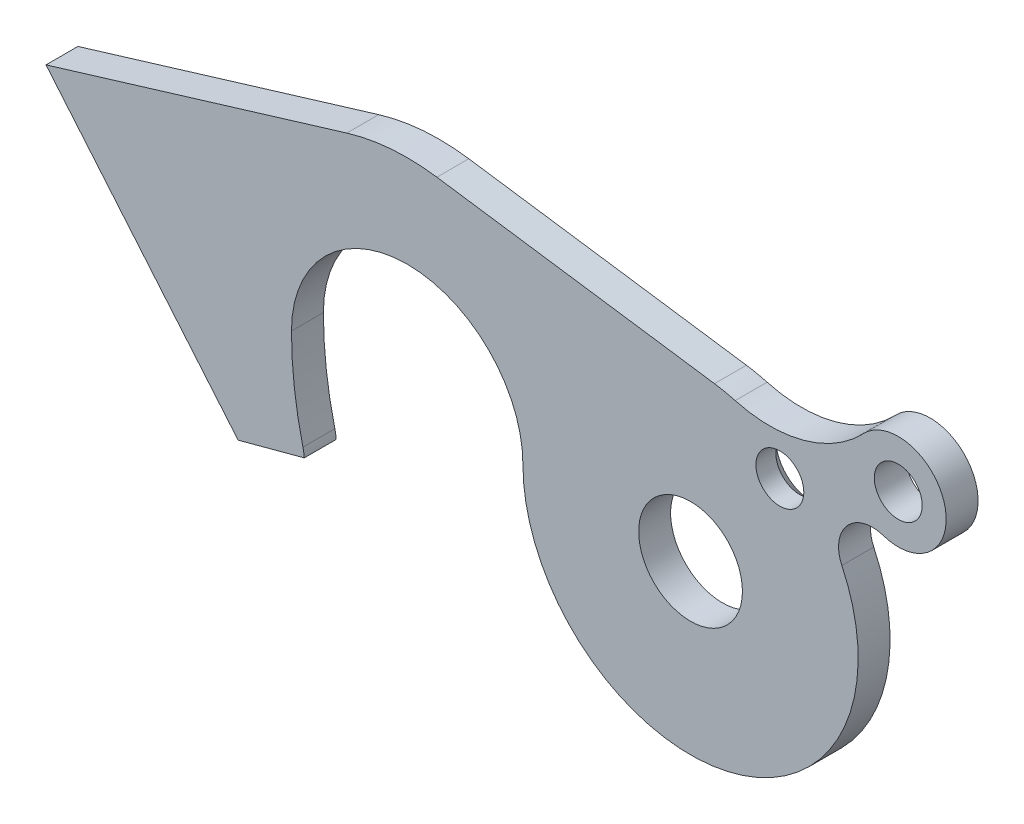
ISO-10303-21;
HEADER;
FILE_DESCRIPTION(('STEP AP214'),'2;1');
FILE_NAME('part.step','',(''),(''),'','','');
FILE_SCHEMA(('AUTOMOTIVE_DESIGN { 1 0 10303 214 1 1 1 1 }'));
ENDSEC;
DATA;
#1=APPLICATION_CONTEXT('core data for automotive mechanical design processes');
#2=APPLICATION_PROTOCOL_DEFINITION('international standard','automotive_design',2000,#1);
#3=PRODUCT_CONTEXT('',#1,'mechanical');
#4=PRODUCT('Part','Part','',(#3));
#5=PRODUCT_RELATED_PRODUCT_CATEGORY('part','',(#4));
#6=PRODUCT_DEFINITION_FORMATION('','',#4);
#7=PRODUCT_DEFINITION_CONTEXT('part definition',#1,'design');
#8=PRODUCT_DEFINITION('design','',#6,#7);
#9=PRODUCT_DEFINITION_SHAPE('','',#8);
#10=(LENGTH_UNIT() NAMED_UNIT(*) SI_UNIT(.MILLI.,.METRE.));
#11=(NAMED_UNIT(*) PLANE_ANGLE_UNIT() SI_UNIT($,.RADIAN.));
#12=(NAMED_UNIT(*) SI_UNIT($,.STERADIAN.) SOLID_ANGLE_UNIT());
#13=UNCERTAINTY_MEASURE_WITH_UNIT(LENGTH_MEASURE(1.E-05),#10,'distance_accuracy_value','');
#14=(GEOMETRIC_REPRESENTATION_CONTEXT(3) GLOBAL_UNCERTAINTY_ASSIGNED_CONTEXT((#13)) GLOBAL_UNIT_ASSIGNED_CONTEXT((#10,
#11,#12)) REPRESENTATION_CONTEXT('',''));
#15=CARTESIAN_POINT('',(0.,0.,0.));
#16=DIRECTION('',(0.,0.,1.));
#17=DIRECTION('',(1.,0.,0.));
#18=AXIS2_PLACEMENT_3D('',#15,#16,#17);
#19=CARTESIAN_POINT('',(-35.5,0.,4.));
#20=DIRECTION('',(0.,0.,1.));
#21=DIRECTION('',(1.,0.,0.));
#22=AXIS2_PLACEMENT_3D('',#19,#20,#21);
#23=PLANE('',#22);
#24=CARTESIAN_POINT('',(0.,0.,4.));
#25=DIRECTION('',(0.,0.,1.));
#26=DIRECTION('',(1.,0.,0.));
#27=AXIS2_PLACEMENT_3D('',#24,#25,#26);
#28=CIRCLE('',#27,6.50000000000001);
#29=CARTESIAN_POINT('',(6.50000000000001,0.,4.));
#30=VERTEX_POINT('',#29);
#31=EDGE_CURVE('E340',#30,#30,#28,.T.);
#32=ORIENTED_EDGE('',*,*,#31,.F.);
#33=EDGE_LOOP('',(#32));
#34=FACE_BOUND('',#33,.T.);
#35=CARTESIAN_POINT('',(-35.5,0.,4.));
#36=DIRECTION('',(0.,0.,1.));
#37=DIRECTION('',(1.,0.,0.));
#38=AXIS2_PLACEMENT_3D('',#35,#36,#37);
#39=CIRCLE('',#38,26.0647693737917);
#40=CARTESIAN_POINT('',(-31.781350826498,25.7981365767639,4.));
#41=VERTEX_POINT('',#40);
#42=CARTESIAN_POINT('',(-43.0721371201122,24.9406283389807,4.));
#43=VERTEX_POINT('',#42);
#44=EDGE_CURVE('E191',#41,#43,#39,.T.);
#45=ORIENTED_EDGE('',*,*,#44,.T.);
#46=DIRECTION('',(-0.956871245676883,-0.290512339147186,0.));
#47=VECTOR('',#46,1.);
#48=CARTESIAN_POINT('',(-43.0721371201122,24.9406283389807,4.));
#49=LINE('',#48,#47);
#50=CARTESIAN_POINT('',(-80.7545581910476,13.5000000000001,4.));
#51=VERTEX_POINT('',#50);
#52=EDGE_CURVE('E114',#43,#51,#49,.T.);
#53=ORIENTED_EDGE('',*,*,#52,.T.);
#54=DIRECTION('',(0.642787609686544,-0.766044443118975,0.));
#55=VECTOR('',#54,1.);
#56=CARTESIAN_POINT('',(-56.6824532304385,-15.1880175681104,4.));
#57=LINE('',#56,#55);
#58=CARTESIAN_POINT('',(-56.6824532304385,-15.1880175681104,4.));
#59=VERTEX_POINT('',#58);
#60=EDGE_CURVE('E303',#51,#59,#57,.T.);
#61=ORIENTED_EDGE('',*,*,#60,.T.);
#62=DIRECTION('',(0.96592582628907,0.258819045102516,0.));
#63=VECTOR('',#62,1.);
#64=CARTESIAN_POINT('',(-56.6824532304385,-15.1880175681104,4.));
#65=LINE('',#64,#63);
#66=CARTESIAN_POINT('',(-48.3929453203943,-12.9668506179627,4.));
#67=VERTEX_POINT('',#66);
#68=EDGE_CURVE('E305',#59,#67,#65,.T.);
#69=ORIENTED_EDGE('',*,*,#68,.T.);
#70=CARTESIAN_POINT('',(-55.1585775575961,-13.5,4.));
#71=DIRECTION('',(0.,0.,1.));
#72=DIRECTION('',(1.,0.,0.));
#73=AXIS2_PLACEMENT_3D('',#70,#71,#72);
#74=CIRCLE('',#73,6.78660650344715);
#75=CARTESIAN_POINT('',(-48.5665379161614,-11.8866056903581,4.));
#76=VERTEX_POINT('',#75);
#77=EDGE_CURVE('E307',#67,#76,#74,.T.);
#78=ORIENTED_EDGE('',*,*,#77,.T.);
#79=CARTESIAN_POINT('',(0.,0.,4.));
#80=DIRECTION('',(0.,0.,-1.));
#81=DIRECTION('',(1.,0.,0.));
#82=AXIS2_PLACEMENT_3D('',#79,#80,#81);
#83=CIRCLE('',#82,50.);
#84=CARTESIAN_POINT('',(-50.,0.,4.));
#85=VERTEX_POINT('',#84);
#86=EDGE_CURVE('E313',#76,#85,#83,.T.);
#87=ORIENTED_EDGE('',*,*,#86,.T.);
#88=CARTESIAN_POINT('',(-35.5,0.,4.));
#89=DIRECTION('',(0.,0.,-1.));
#90=DIRECTION('',(1.,0.,0.));
#91=AXIS2_PLACEMENT_3D('',#88,#89,#90);
#92=CIRCLE('',#91,14.5);
#93=CARTESIAN_POINT('',(-21.,0.,4.));
#94=VERTEX_POINT('',#93);
#95=EDGE_CURVE('E315',#85,#94,#92,.T.);
#96=ORIENTED_EDGE('',*,*,#95,.T.);
#97=CARTESIAN_POINT('',(0.,0.,4.));
#98=DIRECTION('',(0.,0.,1.));
#99=DIRECTION('',(1.,0.,0.));
#100=AXIS2_PLACEMENT_3D('',#97,#98,#99);
#101=CIRCLE('',#100,21.);
#102=CARTESIAN_POINT('',(18.9565120963816,9.03607487462012,4.));
#103=VERTEX_POINT('',#102);
#104=EDGE_CURVE('E317',#94,#103,#101,.T.);
#105=ORIENTED_EDGE('',*,*,#104,.T.);
#106=CARTESIAN_POINT('',(22.7846790467629,10.8608622099863,4.));
#107=DIRECTION('',(0.,0.,-1.));
#108=DIRECTION('',(1.,0.,0.));
#109=AXIS2_PLACEMENT_3D('',#106,#107,#108);
#110=CIRCLE('',#109,4.24083848069045);
#111=CARTESIAN_POINT('',(24.127078994475,14.8836315794241,4.));
#112=VERTEX_POINT('',#111);
#113=EDGE_CURVE('E319',#103,#112,#110,.T.);
#114=ORIENTED_EDGE('',*,*,#113,.T.);
#115=CARTESIAN_POINT('',(26.0263259766335,20.5751042272336,4.));
#116=DIRECTION('',(0.,0.,1.));
#117=DIRECTION('',(1.,0.,0.));
#118=AXIS2_PLACEMENT_3D('',#115,#116,#117);
#119=CIRCLE('',#118,6.00000000000009);
#120=CARTESIAN_POINT('',(21.6754577198551,24.7066832730899,4.));
#121=VERTEX_POINT('',#120);
#122=EDGE_CURVE('E148',#112,#121,#119,.T.);
#123=ORIENTED_EDGE('',*,*,#122,.T.);
#124=CARTESIAN_POINT('',(9.91327085181248,35.876041187281,4.));
#125=DIRECTION('',(0.,0.,-1.));
#126=DIRECTION('',(1.,0.,0.));
#127=AXIS2_PLACEMENT_3D('',#124,#125,#126);
#128=CIRCLE('',#127,16.2204684314004);
#129=CARTESIAN_POINT('',(5.59312380153807,20.2414665017303,4.));
#130=VERTEX_POINT('',#129);
#131=EDGE_CURVE('E142',#121,#130,#128,.T.);
#132=ORIENTED_EDGE('',*,*,#131,.T.);
#133=CARTESIAN_POINT('',(0.,0.,4.));
#134=DIRECTION('',(0.,0.,1.));
#135=DIRECTION('',(1.,0.,0.));
#136=AXIS2_PLACEMENT_3D('',#133,#134,#135);
#137=CIRCLE('',#136,21.);
#138=CARTESIAN_POINT('',(2.99606075632744,20.7851778906123,4.));
#139=VERTEX_POINT('',#138);
#140=EDGE_CURVE('E146',#130,#139,#137,.T.);
#141=ORIENTED_EDGE('',*,*,#140,.T.);
#142=DIRECTION('',(-0.989770375743439,0.142669559825116,0.));
#143=VECTOR('',#142,1.);
#144=CARTESIAN_POINT('',(-31.781350826498,25.7981365767639,4.));
#145=LINE('',#144,#143);
#146=EDGE_CURVE('E55',#139,#41,#145,.T.);
#147=ORIENTED_EDGE('',*,*,#146,.T.);
#148=EDGE_LOOP('',(#45,#53,#61,#69,#78,#87,#96,#105,#114,#123,#132,#141,#147));
#149=FACE_BOUND('',#148,.T.);
#150=CARTESIAN_POINT('',(11.1898425511107,14.5852161177453,4.));
#151=DIRECTION('',(0.,0.,1.));
#152=DIRECTION('',(1.,0.,0.));
#153=AXIS2_PLACEMENT_3D('',#150,#151,#152);
#154=CIRCLE('',#153,3.);
#155=CARTESIAN_POINT('',(14.1898425511107,14.5852161177453,4.));
#156=VERTEX_POINT('',#155);
#157=EDGE_CURVE('E170',#156,#156,#154,.T.);
#158=ORIENTED_EDGE('',*,*,#157,.F.);
#159=EDGE_LOOP('',(#158));
#160=FACE_BOUND('',#159,.T.);
#161=CARTESIAN_POINT('',(26.0263259766335,20.5751042272336,4.));
#162=DIRECTION('',(0.,0.,1.));
#163=DIRECTION('',(1.,0.,0.));
#164=AXIS2_PLACEMENT_3D('',#161,#162,#163);
#165=CIRCLE('',#164,3.);
#166=CARTESIAN_POINT('',(29.0263259766335,20.5751042272336,4.));
#167=VERTEX_POINT('',#166);
#168=EDGE_CURVE('E344',#167,#167,#165,.T.);
#169=ORIENTED_EDGE('',*,*,#168,.F.);
#170=EDGE_LOOP('',(#169));
#171=FACE_BOUND('',#170,.T.);
#172=ADVANCED_FACE('F38',(#34,#149,#160,#171),#23,.T.);
#173=CARTESIAN_POINT('',(-35.5,0.,0.));
#174=DIRECTION('',(0.,0.,1.));
#175=DIRECTION('',(1.,0.,0.));
#176=AXIS2_PLACEMENT_3D('',#173,#174,#175);
#177=PLANE('',#176);
#178=CARTESIAN_POINT('',(11.1898425511107,14.5852161177453,0.));
#179=DIRECTION('',(0.,0.,1.));
#180=DIRECTION('',(1.,0.,0.));
#181=AXIS2_PLACEMENT_3D('',#178,#179,#180);
#182=CIRCLE('',#181,4.50000000000002);
#183=CARTESIAN_POINT('',(15.6898425511108,14.5852161177453,0.));
#184=VERTEX_POINT('',#183);
#185=EDGE_CURVE('E47',#184,#184,#182,.T.);
#186=ORIENTED_EDGE('',*,*,#185,.T.);
#187=EDGE_LOOP('',(#186));
#188=FACE_BOUND('',#187,.T.);
#189=CARTESIAN_POINT('',(-35.5,0.,0.));
#190=DIRECTION('',(0.,0.,1.));
#191=DIRECTION('',(1.,0.,0.));
#192=AXIS2_PLACEMENT_3D('',#189,#190,#191);
#193=CIRCLE('',#192,26.0647693737917);
#194=CARTESIAN_POINT('',(-31.781350826498,25.7981365767639,0.));
#195=VERTEX_POINT('',#194);
#196=CARTESIAN_POINT('',(-43.0721371201122,24.9406283389807,0.));
#197=VERTEX_POINT('',#196);
#198=EDGE_CURVE('E166',#195,#197,#193,.T.);
#199=ORIENTED_EDGE('',*,*,#198,.F.);
#200=DIRECTION('',(-0.989770375743439,0.142669559825116,0.));
#201=VECTOR('',#200,1.);
#202=CARTESIAN_POINT('',(-31.781350826498,25.7981365767639,0.));
#203=LINE('',#202,#201);
#204=CARTESIAN_POINT('',(2.99606075632744,20.7851778906123,0.));
#205=VERTEX_POINT('',#204);
#206=EDGE_CURVE('E105',#205,#195,#203,.T.);
#207=ORIENTED_EDGE('',*,*,#206,.F.);
#208=CARTESIAN_POINT('',(0.,0.,0.));
#209=DIRECTION('',(0.,0.,1.));
#210=DIRECTION('',(1.,0.,0.));
#211=AXIS2_PLACEMENT_3D('',#208,#209,#210);
#212=CIRCLE('',#211,21.);
#213=CARTESIAN_POINT('',(5.59312380153807,20.2414665017303,0.));
#214=VERTEX_POINT('',#213);
#215=EDGE_CURVE('E99',#214,#205,#212,.T.);
#216=ORIENTED_EDGE('',*,*,#215,.F.);
#217=CARTESIAN_POINT('',(9.91327085181248,35.876041187281,0.));
#218=DIRECTION('',(0.,0.,-1.));
#219=DIRECTION('',(1.,0.,0.));
#220=AXIS2_PLACEMENT_3D('',#217,#218,#219);
#221=CIRCLE('',#220,16.2204684314004);
#222=CARTESIAN_POINT('',(21.6754577198551,24.7066832730899,0.));
#223=VERTEX_POINT('',#222);
#224=EDGE_CURVE('E156',#223,#214,#221,.T.);
#225=ORIENTED_EDGE('',*,*,#224,.F.);
#226=CARTESIAN_POINT('',(26.0263259766335,20.5751042272336,0.));
#227=DIRECTION('',(0.,0.,1.));
#228=DIRECTION('',(1.,0.,0.));
#229=AXIS2_PLACEMENT_3D('',#226,#227,#228);
#230=CIRCLE('',#229,6.00000000000009);
#231=CARTESIAN_POINT('',(24.127078994475,14.8836315794241,0.));
#232=VERTEX_POINT('',#231);
#233=EDGE_CURVE('E186',#232,#223,#230,.T.);
#234=ORIENTED_EDGE('',*,*,#233,.F.);
#235=CARTESIAN_POINT('',(22.7846790467629,10.8608622099863,0.));
#236=DIRECTION('',(0.,0.,-1.));
#237=DIRECTION('',(1.,0.,0.));
#238=AXIS2_PLACEMENT_3D('',#235,#236,#237);
#239=CIRCLE('',#238,4.24083848069045);
#240=CARTESIAN_POINT('',(18.9565120963816,9.03607487462012,0.));
#241=VERTEX_POINT('',#240);
#242=EDGE_CURVE('E184',#241,#232,#239,.T.);
#243=ORIENTED_EDGE('',*,*,#242,.F.);
#244=CARTESIAN_POINT('',(0.,0.,0.));
#245=DIRECTION('',(0.,0.,1.));
#246=DIRECTION('',(1.,0.,0.));
#247=AXIS2_PLACEMENT_3D('',#244,#245,#246);
#248=CIRCLE('',#247,21.);
#249=CARTESIAN_POINT('',(-21.,0.,0.));
#250=VERTEX_POINT('',#249);
#251=EDGE_CURVE('E182',#250,#241,#248,.T.);
#252=ORIENTED_EDGE('',*,*,#251,.F.);
#253=CARTESIAN_POINT('',(-35.5,0.,0.));
#254=DIRECTION('',(0.,0.,-1.));
#255=DIRECTION('',(1.,0.,0.));
#256=AXIS2_PLACEMENT_3D('',#253,#254,#255);
#257=CIRCLE('',#256,14.5);
#258=CARTESIAN_POINT('',(-50.,0.,0.));
#259=VERTEX_POINT('',#258);
#260=EDGE_CURVE('E180',#259,#250,#257,.T.);
#261=ORIENTED_EDGE('',*,*,#260,.F.);
#262=CARTESIAN_POINT('',(0.,0.,0.));
#263=DIRECTION('',(0.,0.,-1.));
#264=DIRECTION('',(1.,0.,0.));
#265=AXIS2_PLACEMENT_3D('',#262,#263,#264);
#266=CIRCLE('',#265,50.);
#267=CARTESIAN_POINT('',(-48.5665379161614,-11.8866056903581,0.));
#268=VERTEX_POINT('',#267);
#269=EDGE_CURVE('E178',#268,#259,#266,.T.);
#270=ORIENTED_EDGE('',*,*,#269,.F.);
#271=CARTESIAN_POINT('',(-55.1585775575961,-13.5,0.));
#272=DIRECTION('',(0.,0.,1.));
#273=DIRECTION('',(1.,0.,0.));
#274=AXIS2_PLACEMENT_3D('',#271,#272,#273);
#275=CIRCLE('',#274,6.78660650344715);
#276=CARTESIAN_POINT('',(-48.3929453203943,-12.9668506179627,0.));
#277=VERTEX_POINT('',#276);
#278=EDGE_CURVE('E176',#277,#268,#275,.T.);
#279=ORIENTED_EDGE('',*,*,#278,.F.);
#280=DIRECTION('',(0.96592582628907,0.258819045102516,0.));
#281=VECTOR('',#280,1.);
#282=CARTESIAN_POINT('',(-56.6824532304385,-15.1880175681104,0.));
#283=LINE('',#282,#281);
#284=CARTESIAN_POINT('',(-56.6824532304385,-15.1880175681104,0.));
#285=VERTEX_POINT('',#284);
#286=EDGE_CURVE('E174',#285,#277,#283,.T.);
#287=ORIENTED_EDGE('',*,*,#286,.F.);
#288=DIRECTION('',(0.642787609686544,-0.766044443118975,0.));
#289=VECTOR('',#288,1.);
#290=CARTESIAN_POINT('',(-56.6824532304385,-15.1880175681104,0.));
#291=LINE('',#290,#289);
#292=CARTESIAN_POINT('',(-80.7545581910476,13.5000000000001,0.));
#293=VERTEX_POINT('',#292);
#294=EDGE_CURVE('E172',#293,#285,#291,.T.);
#295=ORIENTED_EDGE('',*,*,#294,.F.);
#296=DIRECTION('',(-0.956871245676883,-0.290512339147186,0.));
#297=VECTOR('',#296,1.);
#298=CARTESIAN_POINT('',(-43.0721371201122,24.9406283389807,0.));
#299=LINE('',#298,#297);
#300=EDGE_CURVE('E169',#197,#293,#299,.T.);
#301=ORIENTED_EDGE('',*,*,#300,.F.);
#302=EDGE_LOOP('',(#199,#207,#216,#225,#234,#243,#252,#261,#270,#279,#287,#295,#301));
#303=FACE_BOUND('',#302,.T.);
#304=CARTESIAN_POINT('',(0.,0.,0.));
#305=DIRECTION('',(0.,0.,1.));
#306=DIRECTION('',(1.,0.,0.));
#307=AXIS2_PLACEMENT_3D('',#304,#305,#306);
#308=CIRCLE('',#307,6.50000000000001);
#309=CARTESIAN_POINT('',(6.50000000000001,0.,0.));
#310=VERTEX_POINT('',#309);
#311=EDGE_CURVE('E341',#310,#310,#308,.T.);
#312=ORIENTED_EDGE('',*,*,#311,.T.);
#313=EDGE_LOOP('',(#312));
#314=FACE_BOUND('',#313,.T.);
#315=CARTESIAN_POINT('',(26.0263259766335,20.5751042272336,0.));
#316=DIRECTION('',(0.,0.,1.));
#317=DIRECTION('',(1.,0.,0.));
#318=AXIS2_PLACEMENT_3D('',#315,#316,#317);
#319=CIRCLE('',#318,3.);
#320=CARTESIAN_POINT('',(29.0263259766335,20.5751042272336,0.));
#321=VERTEX_POINT('',#320);
#322=EDGE_CURVE('E347',#321,#321,#319,.T.);
#323=ORIENTED_EDGE('',*,*,#322,.T.);
#324=EDGE_LOOP('',(#323));
#325=FACE_BOUND('',#324,.T.);
#326=ADVANCED_FACE('F223',(#188,#303,#314,#325),#177,.F.);
#327=CARTESIAN_POINT('',(-35.5,0.,4.));
#328=DIRECTION('',(0.,0.,-1.));
#329=DIRECTION('',(-1.,0.,0.));
#330=AXIS2_PLACEMENT_3D('',#327,#328,#329);
#331=CYLINDRICAL_SURFACE('',#330,26.0647693737917);
#332=ORIENTED_EDGE('',*,*,#198,.T.);
#333=DIRECTION('',(0.,0.,-1.));
#334=VECTOR('',#333,1.);
#335=CARTESIAN_POINT('',(-43.0721371201122,24.9406283389807,4.));
#336=LINE('',#335,#334);
#337=EDGE_CURVE('E219',#43,#197,#336,.T.);
#338=ORIENTED_EDGE('',*,*,#337,.F.);
#339=ORIENTED_EDGE('',*,*,#44,.F.);
#340=DIRECTION('',(0.,0.,-1.));
#341=VECTOR('',#340,1.);
#342=CARTESIAN_POINT('',(-31.781350826498,25.7981365767639,4.));
#343=LINE('',#342,#341);
#344=EDGE_CURVE('E162',#41,#195,#343,.T.);
#345=ORIENTED_EDGE('',*,*,#344,.T.);
#346=EDGE_LOOP('',(#332,#338,#339,#345));
#347=FACE_BOUND('',#346,.T.);
#348=ADVANCED_FACE('F243',(#347),#331,.T.);
#349=CARTESIAN_POINT('',(-43.0721371201122,24.9406283389807,4.));
#350=DIRECTION('',(0.290512339147186,-0.956871245676883,0.));
#351=DIRECTION('',(0.956871245676883,0.290512339147186,0.));
#352=AXIS2_PLACEMENT_3D('',#349,#350,#351);
#353=PLANE('',#352);
#354=ORIENTED_EDGE('',*,*,#300,.T.);
#355=DIRECTION('',(0.,0.,-1.));
#356=VECTOR('',#355,1.);
#357=CARTESIAN_POINT('',(-80.7545581910476,13.5000000000001,4.));
#358=LINE('',#357,#356);
#359=EDGE_CURVE('E216',#51,#293,#358,.T.);
#360=ORIENTED_EDGE('',*,*,#359,.F.);
#361=ORIENTED_EDGE('',*,*,#52,.F.);
#362=ORIENTED_EDGE('',*,*,#337,.T.);
#363=EDGE_LOOP('',(#354,#360,#361,#362));
#364=FACE_BOUND('',#363,.T.);
#365=ADVANCED_FACE('F288',(#364),#353,.F.);
#366=CARTESIAN_POINT('',(-56.6824532304385,-15.1880175681104,4.));
#367=DIRECTION('',(0.766044443118975,0.642787609686544,0.));
#368=DIRECTION('',(-0.642787609686544,0.766044443118975,0.));
#369=AXIS2_PLACEMENT_3D('',#366,#367,#368);
#370=PLANE('',#369);
#371=ORIENTED_EDGE('',*,*,#294,.T.);
#372=DIRECTION('',(0.,0.,-1.));
#373=VECTOR('',#372,1.);
#374=CARTESIAN_POINT('',(-56.6824532304385,-15.1880175681104,4.));
#375=LINE('',#374,#373);
#376=EDGE_CURVE('E213',#59,#285,#375,.T.);
#377=ORIENTED_EDGE('',*,*,#376,.F.);
#378=ORIENTED_EDGE('',*,*,#60,.F.);
#379=ORIENTED_EDGE('',*,*,#359,.T.);
#380=EDGE_LOOP('',(#371,#377,#378,#379));
#381=FACE_BOUND('',#380,.T.);
#382=ADVANCED_FACE('F284',(#381),#370,.F.);
#383=CARTESIAN_POINT('',(-56.6824532304385,-15.1880175681104,4.));
#384=DIRECTION('',(-0.258819045102516,0.96592582628907,0.));
#385=DIRECTION('',(-0.96592582628907,-0.258819045102516,0.));
#386=AXIS2_PLACEMENT_3D('',#383,#384,#385);
#387=PLANE('',#386);
#388=ORIENTED_EDGE('',*,*,#286,.T.);
#389=DIRECTION('',(0.,0.,-1.));
#390=VECTOR('',#389,1.);
#391=CARTESIAN_POINT('',(-48.3929453203943,-12.9668506179627,4.));
#392=LINE('',#391,#390);
#393=EDGE_CURVE('E210',#67,#277,#392,.T.);
#394=ORIENTED_EDGE('',*,*,#393,.F.);
#395=ORIENTED_EDGE('',*,*,#68,.F.);
#396=ORIENTED_EDGE('',*,*,#376,.T.);
#397=EDGE_LOOP('',(#388,#394,#395,#396));
#398=FACE_BOUND('',#397,.T.);
#399=ADVANCED_FACE('F280',(#398),#387,.F.);
#400=CARTESIAN_POINT('',(-55.1585775575961,-13.5,4.));
#401=DIRECTION('',(0.,0.,-1.));
#402=DIRECTION('',(-1.,0.,0.));
#403=AXIS2_PLACEMENT_3D('',#400,#401,#402);
#404=CYLINDRICAL_SURFACE('',#403,6.78660650344715);
#405=ORIENTED_EDGE('',*,*,#278,.T.);
#406=DIRECTION('',(0.,0.,-1.));
#407=VECTOR('',#406,1.);
#408=CARTESIAN_POINT('',(-48.5665379161614,-11.8866056903581,4.));
#409=LINE('',#408,#407);
#410=EDGE_CURVE('E207',#76,#268,#409,.T.);
#411=ORIENTED_EDGE('',*,*,#410,.F.);
#412=ORIENTED_EDGE('',*,*,#77,.F.);
#413=ORIENTED_EDGE('',*,*,#393,.T.);
#414=EDGE_LOOP('',(#405,#411,#412,#413));
#415=FACE_BOUND('',#414,.T.);
#416=ADVANCED_FACE('F276',(#415),#404,.T.);
#417=CARTESIAN_POINT('',(0.,0.,4.));
#418=DIRECTION('',(0.,0.,-1.));
#419=DIRECTION('',(-1.,0.,0.));
#420=AXIS2_PLACEMENT_3D('',#417,#418,#419);
#421=CYLINDRICAL_SURFACE('',#420,50.);
#422=ORIENTED_EDGE('',*,*,#269,.T.);
#423=DIRECTION('',(0.,0.,-1.));
#424=VECTOR('',#423,1.);
#425=CARTESIAN_POINT('',(-50.,0.,4.));
#426=LINE('',#425,#424);
#427=EDGE_CURVE('E204',#85,#259,#426,.T.);
#428=ORIENTED_EDGE('',*,*,#427,.F.);
#429=ORIENTED_EDGE('',*,*,#86,.F.);
#430=ORIENTED_EDGE('',*,*,#410,.T.);
#431=EDGE_LOOP('',(#422,#428,#429,#430));
#432=FACE_BOUND('',#431,.T.);
#433=ADVANCED_FACE('F272',(#432),#421,.F.);
#434=CARTESIAN_POINT('',(-35.5,0.,4.));
#435=DIRECTION('',(0.,0.,-1.));
#436=DIRECTION('',(-1.,0.,0.));
#437=AXIS2_PLACEMENT_3D('',#434,#435,#436);
#438=CYLINDRICAL_SURFACE('',#437,14.5);
#439=ORIENTED_EDGE('',*,*,#260,.T.);
#440=DIRECTION('',(0.,0.,-1.));
#441=VECTOR('',#440,1.);
#442=CARTESIAN_POINT('',(-21.,0.,4.));
#443=LINE('',#442,#441);
#444=EDGE_CURVE('E201',#94,#250,#443,.T.);
#445=ORIENTED_EDGE('',*,*,#444,.F.);
#446=ORIENTED_EDGE('',*,*,#95,.F.);
#447=ORIENTED_EDGE('',*,*,#427,.T.);
#448=EDGE_LOOP('',(#439,#445,#446,#447));
#449=FACE_BOUND('',#448,.T.);
#450=ADVANCED_FACE('F268',(#449),#438,.F.);
#451=CARTESIAN_POINT('',(0.,0.,4.));
#452=DIRECTION('',(0.,0.,-1.));
#453=DIRECTION('',(-1.,0.,0.));
#454=AXIS2_PLACEMENT_3D('',#451,#452,#453);
#455=CYLINDRICAL_SURFACE('',#454,21.);
#456=ORIENTED_EDGE('',*,*,#251,.T.);
#457=DIRECTION('',(0.,0.,-1.));
#458=VECTOR('',#457,1.);
#459=CARTESIAN_POINT('',(18.9565120963816,9.03607487462012,4.));
#460=LINE('',#459,#458);
#461=EDGE_CURVE('E198',#103,#241,#460,.T.);
#462=ORIENTED_EDGE('',*,*,#461,.F.);
#463=ORIENTED_EDGE('',*,*,#104,.F.);
#464=ORIENTED_EDGE('',*,*,#444,.T.);
#465=EDGE_LOOP('',(#456,#462,#463,#464));
#466=FACE_BOUND('',#465,.T.);
#467=ADVANCED_FACE('F264',(#466),#455,.T.);
#468=CARTESIAN_POINT('',(22.7846790467629,10.8608622099863,4.));
#469=DIRECTION('',(0.,0.,-1.));
#470=DIRECTION('',(-1.,0.,0.));
#471=AXIS2_PLACEMENT_3D('',#468,#469,#470);
#472=CYLINDRICAL_SURFACE('',#471,4.24083848069045);
#473=ORIENTED_EDGE('',*,*,#242,.T.);
#474=DIRECTION('',(0.,0.,-1.));
#475=VECTOR('',#474,1.);
#476=CARTESIAN_POINT('',(24.127078994475,14.8836315794241,4.));
#477=LINE('',#476,#475);
#478=EDGE_CURVE('E195',#112,#232,#477,.T.);
#479=ORIENTED_EDGE('',*,*,#478,.F.);
#480=ORIENTED_EDGE('',*,*,#113,.F.);
#481=ORIENTED_EDGE('',*,*,#461,.T.);
#482=EDGE_LOOP('',(#473,#479,#480,#481));
#483=FACE_BOUND('',#482,.T.);
#484=ADVANCED_FACE('F260',(#483),#472,.F.);
#485=CARTESIAN_POINT('',(26.0263259766335,20.5751042272336,4.));
#486=DIRECTION('',(0.,0.,-1.));
#487=DIRECTION('',(-1.,0.,0.));
#488=AXIS2_PLACEMENT_3D('',#485,#486,#487);
#489=CYLINDRICAL_SURFACE('',#488,6.00000000000009);
#490=ORIENTED_EDGE('',*,*,#233,.T.);
#491=DIRECTION('',(0.,0.,-1.));
#492=VECTOR('',#491,1.);
#493=CARTESIAN_POINT('',(21.6754577198551,24.7066832730899,4.));
#494=LINE('',#493,#492);
#495=EDGE_CURVE('E157',#121,#223,#494,.T.);
#496=ORIENTED_EDGE('',*,*,#495,.F.);
#497=ORIENTED_EDGE('',*,*,#122,.F.);
#498=ORIENTED_EDGE('',*,*,#478,.T.);
#499=EDGE_LOOP('',(#490,#496,#497,#498));
#500=FACE_BOUND('',#499,.T.);
#501=ADVANCED_FACE('F257',(#500),#489,.T.);
#502=CARTESIAN_POINT('',(9.91327085181248,35.876041187281,4.));
#503=DIRECTION('',(0.,0.,-1.));
#504=DIRECTION('',(-1.,0.,0.));
#505=AXIS2_PLACEMENT_3D('',#502,#503,#504);
#506=CYLINDRICAL_SURFACE('',#505,16.2204684314004);
#507=ORIENTED_EDGE('',*,*,#224,.T.);
#508=DIRECTION('',(0.,0.,-1.));
#509=VECTOR('',#508,1.);
#510=CARTESIAN_POINT('',(5.59312380153807,20.2414665017303,4.));
#511=LINE('',#510,#509);
#512=EDGE_CURVE('E153',#130,#214,#511,.T.);
#513=ORIENTED_EDGE('',*,*,#512,.F.);
#514=ORIENTED_EDGE('',*,*,#131,.F.);
#515=ORIENTED_EDGE('',*,*,#495,.T.);
#516=EDGE_LOOP('',(#507,#513,#514,#515));
#517=FACE_BOUND('',#516,.T.);
#518=ADVANCED_FACE('F154',(#517),#506,.F.);
#519=CARTESIAN_POINT('',(0.,0.,4.));
#520=DIRECTION('',(0.,0.,-1.));
#521=DIRECTION('',(-1.,0.,0.));
#522=AXIS2_PLACEMENT_3D('',#519,#520,#521);
#523=CYLINDRICAL_SURFACE('',#522,21.);
#524=ORIENTED_EDGE('',*,*,#215,.T.);
#525=DIRECTION('',(0.,0.,-1.));
#526=VECTOR('',#525,1.);
#527=CARTESIAN_POINT('',(2.99606075632744,20.7851778906123,4.));
#528=LINE('',#527,#526);
#529=EDGE_CURVE('E158',#139,#205,#528,.T.);
#530=ORIENTED_EDGE('',*,*,#529,.F.);
#531=ORIENTED_EDGE('',*,*,#140,.F.);
#532=ORIENTED_EDGE('',*,*,#512,.T.);
#533=EDGE_LOOP('',(#524,#530,#531,#532));
#534=FACE_BOUND('',#533,.T.);
#535=ADVANCED_FACE('F160',(#534),#523,.T.);
#536=CARTESIAN_POINT('',(-31.781350826498,25.7981365767639,4.));
#537=DIRECTION('',(-0.142669559825116,-0.989770375743439,0.));
#538=DIRECTION('',(0.989770375743439,-0.142669559825116,0.));
#539=AXIS2_PLACEMENT_3D('',#536,#537,#538);
#540=PLANE('',#539);
#541=ORIENTED_EDGE('',*,*,#206,.T.);
#542=ORIENTED_EDGE('',*,*,#344,.F.);
#543=ORIENTED_EDGE('',*,*,#146,.F.);
#544=ORIENTED_EDGE('',*,*,#529,.T.);
#545=EDGE_LOOP('',(#541,#542,#543,#544));
#546=FACE_BOUND('',#545,.T.);
#547=ADVANCED_FACE('F250',(#546),#540,.F.);
#548=CARTESIAN_POINT('',(11.1898425511107,14.5852161177453,4.));
#549=DIRECTION('',(0.,0.,-1.));
#550=DIRECTION('',(-1.,0.,0.));
#551=AXIS2_PLACEMENT_3D('',#548,#549,#550);
#552=CYLINDRICAL_SURFACE('',#551,3.);
#553=CARTESIAN_POINT('',(11.1898425511107,14.5852161177453,1.50000000000002));
#554=DIRECTION('',(0.,0.,1.));
#555=DIRECTION('',(1.,0.,0.));
#556=AXIS2_PLACEMENT_3D('',#553,#554,#555);
#557=CIRCLE('',#556,3.);
#558=CARTESIAN_POINT('',(14.1898425511107,14.5852161177453,1.50000000000002));
#559=VERTEX_POINT('',#558);
#560=EDGE_CURVE('E11',#559,#559,#557,.F.);
#561=ORIENTED_EDGE('',*,*,#560,.T.);
#562=EDGE_LOOP('',(#561));
#563=FACE_BOUND('',#562,.T.);
#564=ORIENTED_EDGE('',*,*,#157,.T.);
#565=EDGE_LOOP('',(#564));
#566=FACE_BOUND('',#565,.T.);
#567=ADVANCED_FACE('F247',(#563,#566),#552,.F.);
#568=CARTESIAN_POINT('',(0.,0.,4.));
#569=DIRECTION('',(0.,0.,-1.));
#570=DIRECTION('',(-1.,0.,0.));
#571=AXIS2_PLACEMENT_3D('',#568,#569,#570);
#572=CYLINDRICAL_SURFACE('',#571,6.50000000000001);
#573=ORIENTED_EDGE('',*,*,#31,.T.);
#574=EDGE_LOOP('',(#573));
#575=FACE_BOUND('',#574,.T.);
#576=ORIENTED_EDGE('',*,*,#311,.F.);
#577=EDGE_LOOP('',(#576));
#578=FACE_BOUND('',#577,.T.);
#579=ADVANCED_FACE('F232',(#575,#578),#572,.F.);
#580=CARTESIAN_POINT('',(26.0263259766335,20.5751042272336,4.));
#581=DIRECTION('',(0.,0.,-1.));
#582=DIRECTION('',(-1.,0.,0.));
#583=AXIS2_PLACEMENT_3D('',#580,#581,#582);
#584=CYLINDRICAL_SURFACE('',#583,3.);
#585=ORIENTED_EDGE('',*,*,#168,.T.);
#586=EDGE_LOOP('',(#585));
#587=FACE_BOUND('',#586,.T.);
#588=ORIENTED_EDGE('',*,*,#322,.F.);
#589=EDGE_LOOP('',(#588));
#590=FACE_BOUND('',#589,.T.);
#591=ADVANCED_FACE('F227',(#587,#590),#584,.F.);
#592=CARTESIAN_POINT('',(11.1898425511107,14.5852161177453,0.));
#593=DIRECTION('',(0.,0.,-1.));
#594=DIRECTION('',(-1.,0.,0.));
#595=AXIS2_PLACEMENT_3D('',#592,#593,#594);
#596=CONICAL_SURFACE('',#595,4.50000000000002,0.785398163397447);
#597=ORIENTED_EDGE('',*,*,#560,.F.);
#598=EDGE_LOOP('',(#597));
#599=FACE_BOUND('',#598,.T.);
#600=ORIENTED_EDGE('',*,*,#185,.F.);
#601=EDGE_LOOP('',(#600));
#602=FACE_BOUND('',#601,.T.);
#603=ADVANCED_FACE('F40',(#599,#602),#596,.F.);
#604=CLOSED_SHELL('',(#172,#326,#348,#365,#382,#399,#416,#433,#450,#467,#484,#501,#518,#535,
#547,#567,#579,#591,#603));
#605=MANIFOLD_SOLID_BREP('B2',#604);
#606=ADVANCED_BREP_SHAPE_REPRESENTATION('',(#18,#605),#14);
#607=SHAPE_DEFINITION_REPRESENTATION(#9,#606);
ENDSEC;
END-ISO-10303-21;
